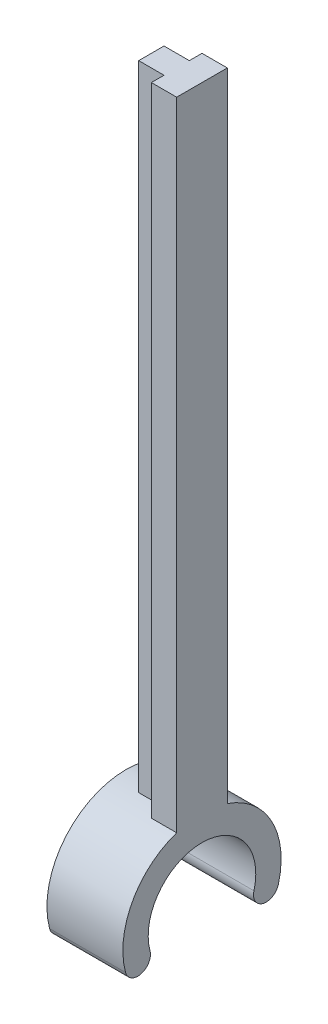
ISO-10303-21;
HEADER;
FILE_DESCRIPTION(('STEP AP214'),'2;1');
FILE_NAME('part.step','',(''),(''),'','','');
FILE_SCHEMA(('AUTOMOTIVE_DESIGN { 1 0 10303 214 1 1 1 1 }'));
ENDSEC;
DATA;
#1=APPLICATION_CONTEXT('core data for automotive mechanical design processes');
#2=APPLICATION_PROTOCOL_DEFINITION('international standard','automotive_design',2000,#1);
#3=PRODUCT_CONTEXT('',#1,'mechanical');
#4=PRODUCT('Part','Part','',(#3));
#5=PRODUCT_RELATED_PRODUCT_CATEGORY('part','',(#4));
#6=PRODUCT_DEFINITION_FORMATION('','',#4);
#7=PRODUCT_DEFINITION_CONTEXT('part definition',#1,'design');
#8=PRODUCT_DEFINITION('design','',#6,#7);
#9=PRODUCT_DEFINITION_SHAPE('','',#8);
#10=(LENGTH_UNIT() NAMED_UNIT(*) SI_UNIT(.MILLI.,.METRE.));
#11=(NAMED_UNIT(*) PLANE_ANGLE_UNIT() SI_UNIT($,.RADIAN.));
#12=(NAMED_UNIT(*) SI_UNIT($,.STERADIAN.) SOLID_ANGLE_UNIT());
#13=UNCERTAINTY_MEASURE_WITH_UNIT(LENGTH_MEASURE(1.E-05),#10,'distance_accuracy_value','');
#14=(GEOMETRIC_REPRESENTATION_CONTEXT(3) GLOBAL_UNCERTAINTY_ASSIGNED_CONTEXT((#13)) GLOBAL_UNIT_ASSIGNED_CONTEXT((#10,
#11,#12)) REPRESENTATION_CONTEXT('',''));
#15=CARTESIAN_POINT('',(0.,0.,0.));
#16=DIRECTION('',(0.,0.,1.));
#17=DIRECTION('',(1.,0.,0.));
#18=AXIS2_PLACEMENT_3D('',#15,#16,#17);
#19=CARTESIAN_POINT('',(2.,0.,0.));
#20=DIRECTION('',(-1.,0.,0.));
#21=DIRECTION('',(0.,0.,1.));
#22=AXIS2_PLACEMENT_3D('',#19,#20,#21);
#23=CYLINDRICAL_SURFACE('',#22,6.25);
#24=DIRECTION('',(-1.,0.,0.));
#25=VECTOR('',#24,1.);
#26=CARTESIAN_POINT('',(2.,6.16948133962653,-1.00000000000001));
#27=LINE('',#26,#25);
#28=CARTESIAN_POINT('',(0.,6.16948133962653,-1.00000000000001));
#29=VERTEX_POINT('',#28);
#30=CARTESIAN_POINT('',(-2.,6.16948133962653,-1.00000000000001));
#31=VERTEX_POINT('',#30);
#32=EDGE_CURVE('E155',#29,#31,#27,.T.);
#33=ORIENTED_EDGE('',*,*,#32,.F.);
#34=CARTESIAN_POINT('',(0.,0.,0.));
#35=DIRECTION('',(1.,0.,0.));
#36=DIRECTION('',(0.,0.,-1.));
#37=AXIS2_PLACEMENT_3D('',#34,#35,#36);
#38=CIRCLE('',#37,6.25);
#39=CARTESIAN_POINT('',(0.,5.92135964116351,-2.));
#40=VERTEX_POINT('',#39);
#41=EDGE_CURVE('E11',#40,#29,#38,.T.);
#42=ORIENTED_EDGE('',*,*,#41,.F.);
#43=DIRECTION('',(-1.,0.,0.));
#44=VECTOR('',#43,1.);
#45=CARTESIAN_POINT('',(2.,5.92135964116351,-2.));
#46=LINE('',#45,#44);
#47=CARTESIAN_POINT('',(2.,5.92135964116351,-2.));
#48=VERTEX_POINT('',#47);
#49=EDGE_CURVE('E206',#48,#40,#46,.T.);
#50=ORIENTED_EDGE('',*,*,#49,.F.);
#51=CARTESIAN_POINT('',(2.,0.,0.));
#52=DIRECTION('',(1.,0.,0.));
#53=DIRECTION('',(0.,0.,-1.));
#54=AXIS2_PLACEMENT_3D('',#51,#52,#53);
#55=CIRCLE('',#54,6.25);
#56=CARTESIAN_POINT('',(2.,-1.61761903189076,-6.03703641430667));
#57=VERTEX_POINT('',#56);
#58=EDGE_CURVE('E234',#57,#48,#55,.T.);
#59=ORIENTED_EDGE('',*,*,#58,.F.);
#60=DIRECTION('',(-1.,0.,0.));
#61=VECTOR('',#60,1.);
#62=CARTESIAN_POINT('',(2.,-1.61761903189076,-6.03703641430667));
#63=LINE('',#62,#61);
#64=CARTESIAN_POINT('',(-4.,-1.61761903189076,-6.03703641430667));
#65=VERTEX_POINT('',#64);
#66=EDGE_CURVE('E248',#57,#65,#63,.T.);
#67=ORIENTED_EDGE('',*,*,#66,.T.);
#68=CARTESIAN_POINT('',(-4.,0.,0.));
#69=DIRECTION('',(1.,0.,0.));
#70=DIRECTION('',(0.,0.,-1.));
#71=AXIS2_PLACEMENT_3D('',#68,#69,#70);
#72=CIRCLE('',#71,6.25);
#73=CARTESIAN_POINT('',(-4.,-1.61761903189076,6.03703641430667));
#74=VERTEX_POINT('',#73);
#75=EDGE_CURVE('E218',#65,#74,#72,.T.);
#76=ORIENTED_EDGE('',*,*,#75,.T.);
#77=DIRECTION('',(-1.,0.,0.));
#78=VECTOR('',#77,1.);
#79=CARTESIAN_POINT('',(2.,-1.61761903189076,6.03703641430667));
#80=LINE('',#79,#78);
#81=CARTESIAN_POINT('',(2.,-1.61761903189076,6.03703641430667));
#82=VERTEX_POINT('',#81);
#83=EDGE_CURVE('E245',#82,#74,#80,.T.);
#84=ORIENTED_EDGE('',*,*,#83,.F.);
#85=CARTESIAN_POINT('',(2.,5.92135964116351,2.));
#86=VERTEX_POINT('',#85);
#87=EDGE_CURVE('E233',#86,#82,#55,.T.);
#88=ORIENTED_EDGE('',*,*,#87,.F.);
#89=DIRECTION('',(-1.,0.,0.));
#90=VECTOR('',#89,1.);
#91=CARTESIAN_POINT('',(2.,5.92135964116351,2.));
#92=LINE('',#91,#90);
#93=CARTESIAN_POINT('',(0.,5.92135964116351,2.));
#94=VERTEX_POINT('',#93);
#95=EDGE_CURVE('E202',#86,#94,#92,.T.);
#96=ORIENTED_EDGE('',*,*,#95,.T.);
#97=CARTESIAN_POINT('',(0.,6.16948133962654,0.999999999999994));
#98=VERTEX_POINT('',#97);
#99=EDGE_CURVE('E50',#98,#94,#38,.T.);
#100=ORIENTED_EDGE('',*,*,#99,.F.);
#101=DIRECTION('',(-1.,0.,0.));
#102=VECTOR('',#101,1.);
#103=CARTESIAN_POINT('',(2.,6.16948133962654,0.999999999999994));
#104=LINE('',#103,#102);
#105=CARTESIAN_POINT('',(-2.,6.16948133962654,0.999999999999994));
#106=VERTEX_POINT('',#105);
#107=EDGE_CURVE('E57',#98,#106,#104,.T.);
#108=ORIENTED_EDGE('',*,*,#107,.T.);
#109=CARTESIAN_POINT('',(-2.,0.,0.));
#110=DIRECTION('',(1.,0.,0.));
#111=DIRECTION('',(0.,0.,-1.));
#112=AXIS2_PLACEMENT_3D('',#109,#110,#111);
#113=CIRCLE('',#112,6.25);
#114=EDGE_CURVE('E61',#31,#106,#113,.T.);
#115=ORIENTED_EDGE('',*,*,#114,.F.);
#116=EDGE_LOOP('',(#33,#42,#50,#59,#67,#76,#84,#88,#96,#100,#108,#115));
#117=FACE_BOUND('',#116,.T.);
#118=ADVANCED_FACE('F41',(#117),#23,.T.);
#119=CARTESIAN_POINT('',(0.,0.,0.));
#120=DIRECTION('',(1.,0.,0.));
#121=DIRECTION('',(0.,0.,-1.));
#122=AXIS2_PLACEMENT_3D('',#119,#120,#121);
#123=PLANE('',#122);
#124=DIRECTION('',(0.,-1.,0.));
#125=VECTOR('',#124,1.);
#126=CARTESIAN_POINT('',(0.,0.,-1.00000000000001));
#127=LINE('',#126,#125);
#128=CARTESIAN_POINT('',(0.,56.25,-1.));
#129=VERTEX_POINT('',#128);
#130=EDGE_CURVE('E160',#129,#29,#127,.T.);
#131=ORIENTED_EDGE('',*,*,#130,.F.);
#132=DIRECTION('',(0.,0.,-1.));
#133=VECTOR('',#132,1.);
#134=CARTESIAN_POINT('',(0.,56.25,0.));
#135=LINE('',#134,#133);
#136=CARTESIAN_POINT('',(0.,56.25,-2.));
#137=VERTEX_POINT('',#136);
#138=EDGE_CURVE('E147',#129,#137,#135,.T.);
#139=ORIENTED_EDGE('',*,*,#138,.T.);
#140=DIRECTION('',(0.,1.,0.));
#141=VECTOR('',#140,1.);
#142=CARTESIAN_POINT('',(0.,0.,-2.));
#143=LINE('',#142,#141);
#144=EDGE_CURVE('E175',#40,#137,#143,.T.);
#145=ORIENTED_EDGE('',*,*,#144,.F.);
#146=ORIENTED_EDGE('',*,*,#41,.T.);
#147=EDGE_LOOP('',(#131,#139,#145,#146));
#148=FACE_BOUND('',#147,.T.);
#149=ADVANCED_FACE('F277',(#148),#123,.F.);
#150=CARTESIAN_POINT('',(2.,0.,0.));
#151=DIRECTION('',(-1.,0.,0.));
#152=DIRECTION('',(0.,0.,1.));
#153=AXIS2_PLACEMENT_3D('',#150,#151,#152);
#154=CYLINDRICAL_SURFACE('',#153,4.25);
#155=DIRECTION('',(-1.,0.,0.));
#156=VECTOR('',#155,1.);
#157=CARTESIAN_POINT('',(2.,-1.09998094168572,4.10518476172854));
#158=LINE('',#157,#156);
#159=CARTESIAN_POINT('',(2.,-1.09998094168572,4.10518476172854));
#160=VERTEX_POINT('',#159);
#161=CARTESIAN_POINT('',(-4.,-1.09998094168572,4.10518476172854));
#162=VERTEX_POINT('',#161);
#163=EDGE_CURVE('E242',#160,#162,#158,.T.);
#164=ORIENTED_EDGE('',*,*,#163,.T.);
#165=CARTESIAN_POINT('',(-4.,0.,0.));
#166=DIRECTION('',(1.,0.,0.));
#167=DIRECTION('',(0.,0.,-1.));
#168=AXIS2_PLACEMENT_3D('',#165,#166,#167);
#169=CIRCLE('',#168,4.25);
#170=CARTESIAN_POINT('',(-4.,-1.09998094168572,-4.10518476172854));
#171=VERTEX_POINT('',#170);
#172=EDGE_CURVE('E210',#171,#162,#169,.T.);
#173=ORIENTED_EDGE('',*,*,#172,.F.);
#174=DIRECTION('',(-1.,0.,0.));
#175=VECTOR('',#174,1.);
#176=CARTESIAN_POINT('',(2.,-1.09998094168572,-4.10518476172854));
#177=LINE('',#176,#175);
#178=CARTESIAN_POINT('',(2.,-1.09998094168572,-4.10518476172854));
#179=VERTEX_POINT('',#178);
#180=EDGE_CURVE('E250',#179,#171,#177,.T.);
#181=ORIENTED_EDGE('',*,*,#180,.F.);
#182=CARTESIAN_POINT('',(2.,0.,0.));
#183=DIRECTION('',(1.,0.,0.));
#184=DIRECTION('',(0.,0.,-1.));
#185=AXIS2_PLACEMENT_3D('',#182,#183,#184);
#186=CIRCLE('',#185,4.25);
#187=EDGE_CURVE('E226',#179,#160,#186,.T.);
#188=ORIENTED_EDGE('',*,*,#187,.T.);
#189=EDGE_LOOP('',(#164,#173,#181,#188));
#190=FACE_BOUND('',#189,.T.);
#191=ADVANCED_FACE('F43',(#190),#154,.F.);
#192=CARTESIAN_POINT('',(2.,-1.35879998678824,-5.07111058801761));
#193=DIRECTION('',(-1.,0.,0.));
#194=DIRECTION('',(0.,0.,1.));
#195=AXIS2_PLACEMENT_3D('',#192,#193,#194);
#196=CYLINDRICAL_SURFACE('',#195,1.);
#197=ORIENTED_EDGE('',*,*,#180,.T.);
#198=CARTESIAN_POINT('',(-4.,-1.35879998678824,-5.07111058801761));
#199=DIRECTION('',(1.,0.,0.));
#200=DIRECTION('',(0.,0.,-1.));
#201=AXIS2_PLACEMENT_3D('',#198,#199,#200);
#202=CIRCLE('',#201,1.);
#203=EDGE_CURVE('E214',#65,#171,#202,.F.);
#204=ORIENTED_EDGE('',*,*,#203,.F.);
#205=ORIENTED_EDGE('',*,*,#66,.F.);
#206=CARTESIAN_POINT('',(2.,-1.35879998678824,-5.07111058801761));
#207=DIRECTION('',(1.,0.,0.));
#208=DIRECTION('',(0.,0.,-1.));
#209=AXIS2_PLACEMENT_3D('',#206,#207,#208);
#210=CIRCLE('',#209,1.);
#211=EDGE_CURVE('E229',#57,#179,#210,.F.);
#212=ORIENTED_EDGE('',*,*,#211,.T.);
#213=EDGE_LOOP('',(#197,#204,#205,#212));
#214=FACE_BOUND('',#213,.T.);
#215=ADVANCED_FACE('F287',(#214),#196,.T.);
#216=CARTESIAN_POINT('',(2.,-1.35879998678824,5.07111058801761));
#217=DIRECTION('',(-1.,0.,0.));
#218=DIRECTION('',(0.,0.,1.));
#219=AXIS2_PLACEMENT_3D('',#216,#217,#218);
#220=CYLINDRICAL_SURFACE('',#219,1.);
#221=ORIENTED_EDGE('',*,*,#83,.T.);
#222=CARTESIAN_POINT('',(-4.,-1.35879998678824,5.07111058801761));
#223=DIRECTION('',(1.,0.,0.));
#224=DIRECTION('',(0.,0.,-1.));
#225=AXIS2_PLACEMENT_3D('',#222,#223,#224);
#226=CIRCLE('',#225,1.);
#227=EDGE_CURVE('E222',#74,#162,#226,.T.);
#228=ORIENTED_EDGE('',*,*,#227,.T.);
#229=ORIENTED_EDGE('',*,*,#163,.F.);
#230=CARTESIAN_POINT('',(2.,-1.35879998678824,5.07111058801761));
#231=DIRECTION('',(1.,0.,0.));
#232=DIRECTION('',(0.,0.,-1.));
#233=AXIS2_PLACEMENT_3D('',#230,#231,#232);
#234=CIRCLE('',#233,1.);
#235=EDGE_CURVE('E238',#82,#160,#234,.T.);
#236=ORIENTED_EDGE('',*,*,#235,.F.);
#237=EDGE_LOOP('',(#221,#228,#229,#236));
#238=FACE_BOUND('',#237,.T.);
#239=ADVANCED_FACE('F285',(#238),#220,.T.);
#240=CARTESIAN_POINT('',(2.,0.,0.));
#241=DIRECTION('',(1.,0.,0.));
#242=DIRECTION('',(0.,0.,-1.));
#243=AXIS2_PLACEMENT_3D('',#240,#241,#242);
#244=PLANE('',#243);
#245=ORIENTED_EDGE('',*,*,#235,.T.);
#246=ORIENTED_EDGE('',*,*,#187,.F.);
#247=ORIENTED_EDGE('',*,*,#211,.F.);
#248=ORIENTED_EDGE('',*,*,#58,.T.);
#249=DIRECTION('',(0.,1.,0.));
#250=VECTOR('',#249,1.);
#251=CARTESIAN_POINT('',(2.,0.,-2.));
#252=LINE('',#251,#250);
#253=CARTESIAN_POINT('',(2.,56.25,-2.));
#254=VERTEX_POINT('',#253);
#255=EDGE_CURVE('E176',#48,#254,#252,.T.);
#256=ORIENTED_EDGE('',*,*,#255,.T.);
#257=DIRECTION('',(0.,0.,-1.));
#258=VECTOR('',#257,1.);
#259=CARTESIAN_POINT('',(2.,56.25,0.));
#260=LINE('',#259,#258);
#261=CARTESIAN_POINT('',(2.,56.25,2.));
#262=VERTEX_POINT('',#261);
#263=EDGE_CURVE('E179',#262,#254,#260,.T.);
#264=ORIENTED_EDGE('',*,*,#263,.F.);
#265=DIRECTION('',(0.,1.,0.));
#266=VECTOR('',#265,1.);
#267=CARTESIAN_POINT('',(2.,0.,2.));
#268=LINE('',#267,#266);
#269=EDGE_CURVE('E184',#86,#262,#268,.T.);
#270=ORIENTED_EDGE('',*,*,#269,.F.);
#271=ORIENTED_EDGE('',*,*,#87,.T.);
#272=EDGE_LOOP('',(#245,#246,#247,#248,#256,#264,#270,#271));
#273=FACE_BOUND('',#272,.T.);
#274=ADVANCED_FACE('F293',(#273),#244,.T.);
#275=CARTESIAN_POINT('',(-4.,0.,0.));
#276=DIRECTION('',(1.,0.,0.));
#277=DIRECTION('',(0.,0.,-1.));
#278=AXIS2_PLACEMENT_3D('',#275,#276,#277);
#279=PLANE('',#278);
#280=ORIENTED_EDGE('',*,*,#172,.T.);
#281=ORIENTED_EDGE('',*,*,#227,.F.);
#282=ORIENTED_EDGE('',*,*,#75,.F.);
#283=ORIENTED_EDGE('',*,*,#203,.T.);
#284=EDGE_LOOP('',(#280,#281,#282,#283));
#285=FACE_BOUND('',#284,.T.);
#286=ADVANCED_FACE('F304',(#285),#279,.F.);
#287=CARTESIAN_POINT('',(2.,0.,-2.));
#288=DIRECTION('',(0.,0.,1.));
#289=DIRECTION('',(0.,-1.,0.));
#290=AXIS2_PLACEMENT_3D('',#287,#288,#289);
#291=PLANE('',#290);
#292=ORIENTED_EDGE('',*,*,#255,.F.);
#293=ORIENTED_EDGE('',*,*,#49,.T.);
#294=ORIENTED_EDGE('',*,*,#144,.T.);
#295=DIRECTION('',(-1.,0.,0.));
#296=VECTOR('',#295,1.);
#297=CARTESIAN_POINT('',(2.,56.25,-2.));
#298=LINE('',#297,#296);
#299=EDGE_CURVE('E199',#254,#137,#298,.T.);
#300=ORIENTED_EDGE('',*,*,#299,.F.);
#301=EDGE_LOOP('',(#292,#293,#294,#300));
#302=FACE_BOUND('',#301,.T.);
#303=ADVANCED_FACE('F315',(#302),#291,.F.);
#304=CARTESIAN_POINT('',(2.,0.,2.));
#305=DIRECTION('',(0.,0.,1.));
#306=DIRECTION('',(0.,-1.,0.));
#307=AXIS2_PLACEMENT_3D('',#304,#305,#306);
#308=PLANE('',#307);
#309=ORIENTED_EDGE('',*,*,#95,.F.);
#310=ORIENTED_EDGE('',*,*,#269,.T.);
#311=DIRECTION('',(-1.,0.,0.));
#312=VECTOR('',#311,1.);
#313=CARTESIAN_POINT('',(2.,56.25,2.));
#314=LINE('',#313,#312);
#315=CARTESIAN_POINT('',(0.,56.25,2.));
#316=VERTEX_POINT('',#315);
#317=EDGE_CURVE('E187',#262,#316,#314,.T.);
#318=ORIENTED_EDGE('',*,*,#317,.T.);
#319=DIRECTION('',(0.,1.,0.));
#320=VECTOR('',#319,1.);
#321=CARTESIAN_POINT('',(0.,0.,2.));
#322=LINE('',#321,#320);
#323=EDGE_CURVE('E180',#94,#316,#322,.T.);
#324=ORIENTED_EDGE('',*,*,#323,.F.);
#325=EDGE_LOOP('',(#309,#310,#318,#324));
#326=FACE_BOUND('',#325,.T.);
#327=ADVANCED_FACE('F263',(#326),#308,.T.);
#328=CARTESIAN_POINT('',(2.,56.25,0.));
#329=DIRECTION('',(0.,1.,0.));
#330=DIRECTION('',(0.,0.,1.));
#331=AXIS2_PLACEMENT_3D('',#328,#329,#330);
#332=PLANE('',#331);
#333=CARTESIAN_POINT('',(0.,56.25,1.));
#334=VERTEX_POINT('',#333);
#335=EDGE_CURVE('E191',#316,#334,#135,.T.);
#336=ORIENTED_EDGE('',*,*,#335,.F.);
#337=ORIENTED_EDGE('',*,*,#317,.F.);
#338=ORIENTED_EDGE('',*,*,#263,.T.);
#339=ORIENTED_EDGE('',*,*,#299,.T.);
#340=ORIENTED_EDGE('',*,*,#138,.F.);
#341=DIRECTION('',(1.,0.,0.));
#342=VECTOR('',#341,1.);
#343=CARTESIAN_POINT('',(-2.,56.25,-1.));
#344=LINE('',#343,#342);
#345=CARTESIAN_POINT('',(-2.,56.25,-1.));
#346=VERTEX_POINT('',#345);
#347=EDGE_CURVE('E143',#346,#129,#344,.T.);
#348=ORIENTED_EDGE('',*,*,#347,.F.);
#349=DIRECTION('',(0.,0.,-1.));
#350=VECTOR('',#349,1.);
#351=CARTESIAN_POINT('',(-2.,56.25,0.));
#352=LINE('',#351,#350);
#353=CARTESIAN_POINT('',(-2.,56.25,1.));
#354=VERTEX_POINT('',#353);
#355=EDGE_CURVE('E131',#354,#346,#352,.T.);
#356=ORIENTED_EDGE('',*,*,#355,.F.);
#357=DIRECTION('',(1.,0.,0.));
#358=VECTOR('',#357,1.);
#359=CARTESIAN_POINT('',(-2.,56.25,1.));
#360=LINE('',#359,#358);
#361=EDGE_CURVE('E152',#354,#334,#360,.T.);
#362=ORIENTED_EDGE('',*,*,#361,.T.);
#363=EDGE_LOOP('',(#336,#337,#338,#339,#340,#348,#356,#362));
#364=FACE_BOUND('',#363,.T.);
#365=ADVANCED_FACE('F145',(#364),#332,.T.);
#366=ORIENTED_EDGE('',*,*,#335,.T.);
#367=DIRECTION('',(0.,-1.,0.));
#368=VECTOR('',#367,1.);
#369=CARTESIAN_POINT('',(0.,0.,0.999999999999994));
#370=LINE('',#369,#368);
#371=EDGE_CURVE('E157',#334,#98,#370,.T.);
#372=ORIENTED_EDGE('',*,*,#371,.T.);
#373=ORIENTED_EDGE('',*,*,#99,.T.);
#374=ORIENTED_EDGE('',*,*,#323,.T.);
#375=EDGE_LOOP('',(#366,#372,#373,#374));
#376=FACE_BOUND('',#375,.T.);
#377=ADVANCED_FACE('F256',(#376),#123,.F.);
#378=CARTESIAN_POINT('',(-2.,0.,-1.00000000000001));
#379=DIRECTION('',(0.,0.,1.));
#380=DIRECTION('',(0.,-1.,0.));
#381=AXIS2_PLACEMENT_3D('',#378,#379,#380);
#382=PLANE('',#381);
#383=ORIENTED_EDGE('',*,*,#130,.T.);
#384=ORIENTED_EDGE('',*,*,#32,.T.);
#385=DIRECTION('',(0.,-1.,0.));
#386=VECTOR('',#385,1.);
#387=CARTESIAN_POINT('',(-2.,0.,-1.00000000000001));
#388=LINE('',#387,#386);
#389=EDGE_CURVE('E135',#346,#31,#388,.T.);
#390=ORIENTED_EDGE('',*,*,#389,.F.);
#391=ORIENTED_EDGE('',*,*,#347,.T.);
#392=EDGE_LOOP('',(#383,#384,#390,#391));
#393=FACE_BOUND('',#392,.T.);
#394=ADVANCED_FACE('F154',(#393),#382,.F.);
#395=CARTESIAN_POINT('',(-2.,0.,0.999999999999994));
#396=DIRECTION('',(0.,0.,1.));
#397=DIRECTION('',(0.,-1.,0.));
#398=AXIS2_PLACEMENT_3D('',#395,#396,#397);
#399=PLANE('',#398);
#400=ORIENTED_EDGE('',*,*,#107,.F.);
#401=ORIENTED_EDGE('',*,*,#371,.F.);
#402=ORIENTED_EDGE('',*,*,#361,.F.);
#403=DIRECTION('',(0.,-1.,0.));
#404=VECTOR('',#403,1.);
#405=CARTESIAN_POINT('',(-2.,0.,0.999999999999994));
#406=LINE('',#405,#404);
#407=EDGE_CURVE('E137',#354,#106,#406,.T.);
#408=ORIENTED_EDGE('',*,*,#407,.T.);
#409=EDGE_LOOP('',(#400,#401,#402,#408));
#410=FACE_BOUND('',#409,.T.);
#411=ADVANCED_FACE('F267',(#410),#399,.T.);
#412=CARTESIAN_POINT('',(-2.,0.,0.));
#413=DIRECTION('',(1.,0.,0.));
#414=DIRECTION('',(0.,0.,-1.));
#415=AXIS2_PLACEMENT_3D('',#412,#413,#414);
#416=PLANE('',#415);
#417=ORIENTED_EDGE('',*,*,#389,.T.);
#418=ORIENTED_EDGE('',*,*,#114,.T.);
#419=ORIENTED_EDGE('',*,*,#407,.F.);
#420=ORIENTED_EDGE('',*,*,#355,.T.);
#421=EDGE_LOOP('',(#417,#418,#419,#420));
#422=FACE_BOUND('',#421,.T.);
#423=ADVANCED_FACE('F133',(#422),#416,.F.);
#424=CLOSED_SHELL('',(#118,#149,#191,#215,#239,#274,#286,#303,#327,#365,#377,#394,#411,#423));
#425=MANIFOLD_SOLID_BREP('B2',#424);
#426=ADVANCED_BREP_SHAPE_REPRESENTATION('',(#18,#425),#14);
#427=SHAPE_DEFINITION_REPRESENTATION(#9,#426);
ENDSEC;
END-ISO-10303-21;
